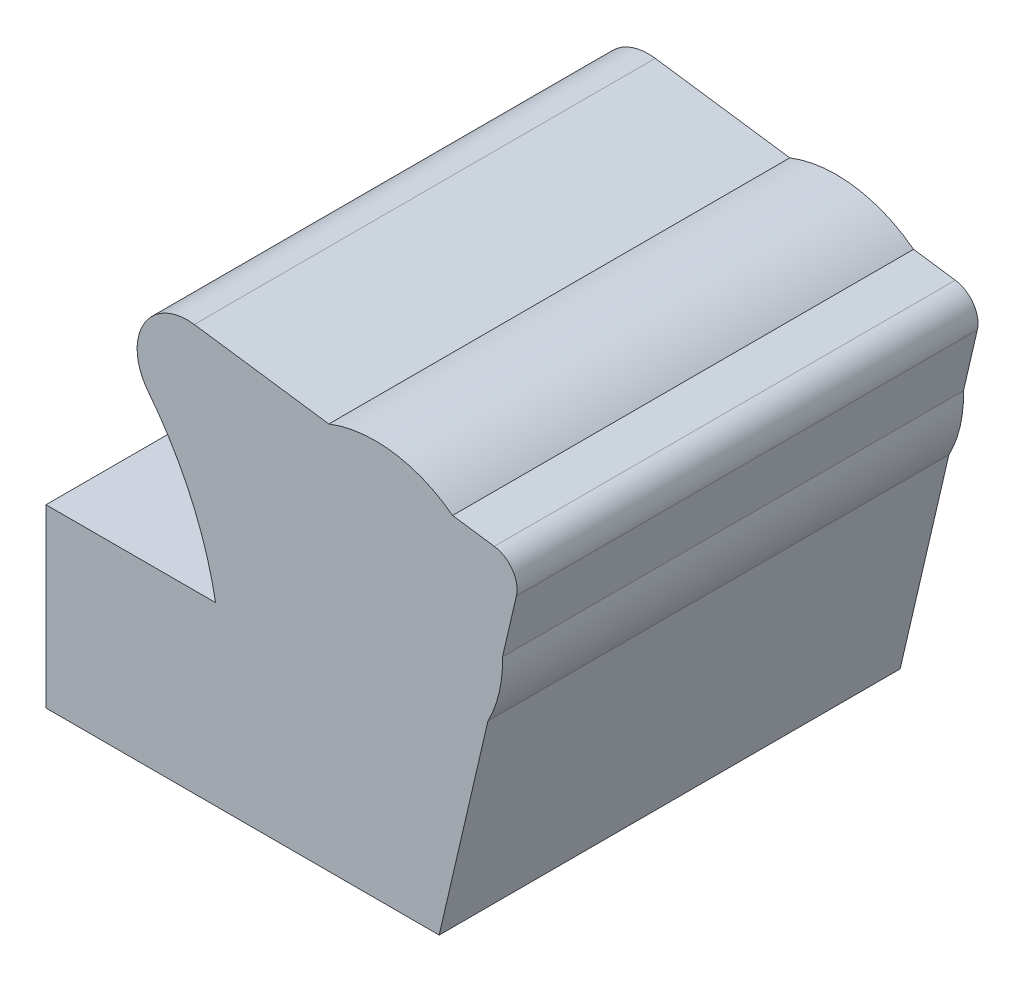
ISO-10303-21;
HEADER;
FILE_DESCRIPTION(('STEP AP214'),'2;1');
FILE_NAME('part.step','',(''),(''),'','','');
FILE_SCHEMA(('AUTOMOTIVE_DESIGN { 1 0 10303 214 1 1 1 1 }'));
ENDSEC;
DATA;
#1=APPLICATION_CONTEXT('core data for automotive mechanical design processes');
#2=APPLICATION_PROTOCOL_DEFINITION('international standard','automotive_design',2000,#1);
#3=PRODUCT_CONTEXT('',#1,'mechanical');
#4=PRODUCT('Part','Part','',(#3));
#5=PRODUCT_RELATED_PRODUCT_CATEGORY('part','',(#4));
#6=PRODUCT_DEFINITION_FORMATION('','',#4);
#7=PRODUCT_DEFINITION_CONTEXT('part definition',#1,'design');
#8=PRODUCT_DEFINITION('design','',#6,#7);
#9=PRODUCT_DEFINITION_SHAPE('','',#8);
#10=(LENGTH_UNIT() NAMED_UNIT(*) SI_UNIT(.MILLI.,.METRE.));
#11=(NAMED_UNIT(*) PLANE_ANGLE_UNIT() SI_UNIT($,.RADIAN.));
#12=(NAMED_UNIT(*) SI_UNIT($,.STERADIAN.) SOLID_ANGLE_UNIT());
#13=UNCERTAINTY_MEASURE_WITH_UNIT(LENGTH_MEASURE(1.E-05),#10,'distance_accuracy_value','');
#14=(GEOMETRIC_REPRESENTATION_CONTEXT(3) GLOBAL_UNCERTAINTY_ASSIGNED_CONTEXT((#13)) GLOBAL_UNIT_ASSIGNED_CONTEXT((#10,
#11,#12)) REPRESENTATION_CONTEXT('',''));
#15=CARTESIAN_POINT('',(0.,0.,0.));
#16=DIRECTION('',(0.,0.,1.));
#17=DIRECTION('',(1.,0.,0.));
#18=AXIS2_PLACEMENT_3D('',#15,#16,#17);
#19=CARTESIAN_POINT('',(19.0917847936775,72.5960375247347,50.));
#20=DIRECTION('',(0.,0.,-1.));
#21=DIRECTION('',(-1.,0.,0.));
#22=AXIS2_PLACEMENT_3D('',#19,#20,#21);
#23=CYLINDRICAL_SURFACE('',#22,74.3600000001127);
#24=CARTESIAN_POINT('',(19.0917847936775,72.5960375247347,-50.));
#25=DIRECTION('',(0.,0.,1.));
#26=DIRECTION('',(1.,0.,0.));
#27=AXIS2_PLACEMENT_3D('',#24,#25,#26);
#28=CIRCLE('',#27,74.3600000001127);
#29=CARTESIAN_POINT('',(77.5087076973694,118.605522617277,-50.));
#30=VERTEX_POINT('',#29);
#31=CARTESIAN_POINT('',(92.2028645129567,86.1673168416586,-50.));
#32=VERTEX_POINT('',#31);
#33=EDGE_CURVE('E238',#30,#32,#28,.F.);
#34=ORIENTED_EDGE('',*,*,#33,.T.);
#35=DIRECTION('',(0.,0.,-1.));
#36=VECTOR('',#35,1.);
#37=CARTESIAN_POINT('',(92.2028645129567,86.1673168416586,50.));
#38=LINE('',#37,#36);
#39=CARTESIAN_POINT('',(92.2028645129567,86.1673168416586,50.));
#40=VERTEX_POINT('',#39);
#41=EDGE_CURVE('E253',#40,#32,#38,.T.);
#42=ORIENTED_EDGE('',*,*,#41,.F.);
#43=CARTESIAN_POINT('',(19.0917847936775,72.5960375247347,50.));
#44=DIRECTION('',(0.,0.,1.));
#45=DIRECTION('',(1.,0.,0.));
#46=AXIS2_PLACEMENT_3D('',#43,#44,#45);
#47=CIRCLE('',#46,74.3600000001127);
#48=CARTESIAN_POINT('',(77.5087076973694,118.605522617277,50.));
#49=VERTEX_POINT('',#48);
#50=EDGE_CURVE('E283',#49,#40,#47,.F.);
#51=ORIENTED_EDGE('',*,*,#50,.F.);
#52=DIRECTION('',(0.,0.,-1.));
#53=VECTOR('',#52,1.);
#54=CARTESIAN_POINT('',(77.5087076973694,118.605522617277,50.));
#55=LINE('',#54,#53);
#56=EDGE_CURVE('E255',#49,#30,#55,.T.);
#57=ORIENTED_EDGE('',*,*,#56,.T.);
#58=EDGE_LOOP('',(#34,#42,#51,#57));
#59=FACE_BOUND('',#58,.T.);
#60=ADVANCED_FACE('F91',(#59),#23,.F.);
#61=CARTESIAN_POINT('',(86.0571495833471,125.338321778331,50.));
#62=DIRECTION('',(0.,0.,-1.));
#63=DIRECTION('',(-1.,0.,0.));
#64=AXIS2_PLACEMENT_3D('',#61,#62,#63);
#65=CYLINDRICAL_SURFACE('',#64,10.8814724748553);
#66=CARTESIAN_POINT('',(86.0571495833471,125.338321778331,-50.));
#67=DIRECTION('',(0.,0.,1.));
#68=DIRECTION('',(1.,0.,0.));
#69=AXIS2_PLACEMENT_3D('',#66,#67,#68);
#70=CIRCLE('',#69,10.8814724748553);
#71=CARTESIAN_POINT('',(87.5697361875638,136.114152372108,-50.));
#72=VERTEX_POINT('',#71);
#73=EDGE_CURVE('E236',#72,#30,#70,.T.);
#74=ORIENTED_EDGE('',*,*,#73,.T.);
#75=ORIENTED_EDGE('',*,*,#56,.F.);
#76=CARTESIAN_POINT('',(86.0571495833471,125.338321778331,50.));
#77=DIRECTION('',(0.,0.,1.));
#78=DIRECTION('',(1.,0.,0.));
#79=AXIS2_PLACEMENT_3D('',#76,#77,#78);
#80=CIRCLE('',#79,10.8814724748553);
#81=CARTESIAN_POINT('',(87.5697361875638,136.114152372108,50.));
#82=VERTEX_POINT('',#81);
#83=EDGE_CURVE('E281',#82,#49,#80,.T.);
#84=ORIENTED_EDGE('',*,*,#83,.F.);
#85=DIRECTION('',(0.,0.,-1.));
#86=VECTOR('',#85,1.);
#87=CARTESIAN_POINT('',(87.5697361875638,136.114152372108,50.));
#88=LINE('',#87,#86);
#89=EDGE_CURVE('E258',#82,#72,#88,.T.);
#90=ORIENTED_EDGE('',*,*,#89,.T.);
#91=EDGE_LOOP('',(#74,#75,#84,#90));
#92=FACE_BOUND('',#91,.T.);
#93=ADVANCED_FACE('F279',(#92),#65,.T.);
#94=CARTESIAN_POINT('',(20.4290257841441,145.538589613398,50.));
#95=DIRECTION('',(-0.139005691344815,-0.990291582198774,0.));
#96=DIRECTION('',(0.990291582198774,-0.139005691344815,0.));
#97=AXIS2_PLACEMENT_3D('',#94,#95,#96);
#98=PLANE('',#97);
#99=DIRECTION('',(-0.990291582198774,0.139005691344815,0.));
#100=VECTOR('',#99,1.);
#101=CARTESIAN_POINT('',(20.4290257841441,145.538589613398,-50.));
#102=LINE('',#101,#100);
#103=CARTESIAN_POINT('',(116.763782975271,132.016229366575,-50.));
#104=VERTEX_POINT('',#103);
#105=EDGE_CURVE('E234',#104,#72,#102,.T.);
#106=ORIENTED_EDGE('',*,*,#105,.T.);
#107=ORIENTED_EDGE('',*,*,#89,.F.);
#108=DIRECTION('',(-0.990291582198774,0.139005691344815,0.));
#109=VECTOR('',#108,1.);
#110=CARTESIAN_POINT('',(20.4290257841441,145.538589613398,50.));
#111=LINE('',#110,#109);
#112=CARTESIAN_POINT('',(116.763782975271,132.016229366575,50.));
#113=VERTEX_POINT('',#112);
#114=EDGE_CURVE('E284',#113,#82,#111,.T.);
#115=ORIENTED_EDGE('',*,*,#114,.F.);
#116=DIRECTION('',(0.,0.,-1.));
#117=VECTOR('',#116,1.);
#118=CARTESIAN_POINT('',(116.763782975271,132.016229366575,50.));
#119=LINE('',#118,#117);
#120=EDGE_CURVE('E261',#113,#104,#119,.T.);
#121=ORIENTED_EDGE('',*,*,#120,.T.);
#122=EDGE_LOOP('',(#106,#107,#115,#121));
#123=FACE_BOUND('',#122,.T.);
#124=ADVANCED_FACE('F275',(#123),#98,.F.);
#125=CARTESIAN_POINT('',(126.840999999996,106.3205,50.));
#126=DIRECTION('',(0.,0.,-1.));
#127=DIRECTION('',(-1.,0.,0.));
#128=AXIS2_PLACEMENT_3D('',#125,#126,#127);
#129=CYLINDRICAL_SURFACE('',#128,27.6011016201112);
#130=CARTESIAN_POINT('',(126.840999999996,106.3205,-50.));
#131=DIRECTION('',(0.,0.,1.));
#132=DIRECTION('',(1.,0.,0.));
#133=AXIS2_PLACEMENT_3D('',#130,#131,#132);
#134=CIRCLE('',#133,27.6011016201112);
#135=CARTESIAN_POINT('',(143.603132490778,128.248831559997,-50.));
#136=VERTEX_POINT('',#135);
#137=EDGE_CURVE('E231',#136,#104,#134,.T.);
#138=ORIENTED_EDGE('',*,*,#137,.T.);
#139=ORIENTED_EDGE('',*,*,#120,.F.);
#140=CARTESIAN_POINT('',(126.840999999996,106.3205,50.));
#141=DIRECTION('',(0.,0.,1.));
#142=DIRECTION('',(1.,0.,0.));
#143=AXIS2_PLACEMENT_3D('',#140,#141,#142);
#144=CIRCLE('',#143,27.6011016201112);
#145=CARTESIAN_POINT('',(143.603132490778,128.248831559997,50.));
#146=VERTEX_POINT('',#145);
#147=EDGE_CURVE('E268',#146,#113,#144,.T.);
#148=ORIENTED_EDGE('',*,*,#147,.F.);
#149=DIRECTION('',(0.,0.,-1.));
#150=VECTOR('',#149,1.);
#151=CARTESIAN_POINT('',(143.603132490778,128.248831559997,50.));
#152=LINE('',#151,#150);
#153=EDGE_CURVE('E209',#146,#136,#152,.T.);
#154=ORIENTED_EDGE('',*,*,#153,.T.);
#155=EDGE_LOOP('',(#138,#139,#148,#154));
#156=FACE_BOUND('',#155,.T.);
#157=ADVANCED_FACE('F264',(#156),#129,.T.);
#158=CARTESIAN_POINT('',(20.4290257841441,145.538589613398,50.));
#159=DIRECTION('',(-0.139005691344815,-0.990291582198774,0.));
#160=DIRECTION('',(0.990291582198774,-0.139005691344815,0.));
#161=AXIS2_PLACEMENT_3D('',#158,#159,#160);
#162=PLANE('',#161);
#163=DIRECTION('',(-0.990291582198774,0.139005691344815,0.));
#164=VECTOR('',#163,1.);
#165=CARTESIAN_POINT('',(20.4290257841441,145.538589613398,-50.));
#166=LINE('',#165,#164);
#167=CARTESIAN_POINT('',(152.661112554492,126.977376966646,-50.));
#168=VERTEX_POINT('',#167);
#169=EDGE_CURVE('E228',#168,#136,#166,.T.);
#170=ORIENTED_EDGE('',*,*,#169,.T.);
#171=ORIENTED_EDGE('',*,*,#153,.F.);
#172=DIRECTION('',(-0.990291582198774,0.139005691344815,0.));
#173=VECTOR('',#172,1.);
#174=CARTESIAN_POINT('',(20.4290257841441,145.538589613398,50.));
#175=LINE('',#174,#173);
#176=CARTESIAN_POINT('',(152.661112554492,126.977376966646,50.));
#177=VERTEX_POINT('',#176);
#178=EDGE_CURVE('E200',#177,#146,#175,.T.);
#179=ORIENTED_EDGE('',*,*,#178,.F.);
#180=DIRECTION('',(0.,0.,-1.));
#181=VECTOR('',#180,1.);
#182=CARTESIAN_POINT('',(152.661112554492,126.977376966646,50.));
#183=LINE('',#182,#181);
#184=EDGE_CURVE('E198',#177,#168,#183,.T.);
#185=ORIENTED_EDGE('',*,*,#184,.T.);
#186=EDGE_LOOP('',(#170,#171,#179,#185));
#187=FACE_BOUND('',#186,.T.);
#188=ADVANCED_FACE('F270',(#187),#162,.F.);
#189=CARTESIAN_POINT('',(151.866,121.312909116469,50.));
#190=DIRECTION('',(0.,0.,-1.));
#191=DIRECTION('',(-1.,0.,0.));
#192=AXIS2_PLACEMENT_3D('',#189,#190,#191);
#193=CYLINDRICAL_SURFACE('',#192,5.71999999999969);
#194=CARTESIAN_POINT('',(151.866,121.312909116469,-50.));
#195=DIRECTION('',(0.,0.,1.));
#196=DIRECTION('',(1.,0.,0.));
#197=AXIS2_PLACEMENT_3D('',#194,#195,#196);
#198=CIRCLE('',#197,5.71999999999969);
#199=CARTESIAN_POINT('',(157.437634446656,120.018579331278,-50.));
#200=VERTEX_POINT('',#199);
#201=EDGE_CURVE('E221',#200,#168,#198,.T.);
#202=ORIENTED_EDGE('',*,*,#201,.T.);
#203=ORIENTED_EDGE('',*,*,#184,.F.);
#204=CARTESIAN_POINT('',(151.866,121.312909116469,50.));
#205=DIRECTION('',(0.,0.,1.));
#206=DIRECTION('',(1.,0.,0.));
#207=AXIS2_PLACEMENT_3D('',#204,#205,#206);
#208=CIRCLE('',#207,5.71999999999969);
#209=CARTESIAN_POINT('',(157.437634446656,120.018579331278,50.));
#210=VERTEX_POINT('',#209);
#211=EDGE_CURVE('E184',#210,#177,#208,.T.);
#212=ORIENTED_EDGE('',*,*,#211,.F.);
#213=DIRECTION('',(0.,0.,-1.));
#214=VECTOR('',#213,1.);
#215=CARTESIAN_POINT('',(157.437634446656,120.018579331278,50.));
#216=LINE('',#215,#214);
#217=EDGE_CURVE('E196',#210,#200,#216,.T.);
#218=ORIENTED_EDGE('',*,*,#217,.T.);
#219=EDGE_LOOP('',(#202,#203,#212,#218));
#220=FACE_BOUND('',#219,.T.);
#221=ADVANCED_FACE('F195',(#220),#193,.T.);
#222=CARTESIAN_POINT('',(122.922758843374,-28.5558195843687,50.));
#223=DIRECTION('',(-0.974061966198678,0.22628143097737,0.));
#224=DIRECTION('',(-0.22628143097737,-0.974061966198678,0.));
#225=AXIS2_PLACEMENT_3D('',#222,#223,#224);
#226=PLANE('',#225);
#227=DIRECTION('',(0.,0.,-1.));
#228=VECTOR('',#227,1.);
#229=CARTESIAN_POINT('',(154.431677752707,107.07899310465,50.));
#230=LINE('',#229,#228);
#231=CARTESIAN_POINT('',(154.431677752707,107.07899310465,-50.));
#232=VERTEX_POINT('',#231);
#233=CARTESIAN_POINT('',(154.431677752707,107.07899310465,50.));
#234=VERTEX_POINT('',#233);
#235=EDGE_CURVE('E99',#232,#234,#230,.F.);
#236=ORIENTED_EDGE('',*,*,#235,.F.);
#237=DIRECTION('',(0.22628143097737,0.974061966198678,0.));
#238=VECTOR('',#237,1.);
#239=CARTESIAN_POINT('',(122.922758843374,-28.5558195843687,-50.));
#240=LINE('',#239,#238);
#241=EDGE_CURVE('E204',#232,#200,#240,.T.);
#242=ORIENTED_EDGE('',*,*,#241,.T.);
#243=ORIENTED_EDGE('',*,*,#217,.F.);
#244=DIRECTION('',(0.22628143097737,0.974061966198678,0.));
#245=VECTOR('',#244,1.);
#246=CARTESIAN_POINT('',(122.922758843374,-28.5558195843687,50.));
#247=LINE('',#246,#245);
#248=EDGE_CURVE('E179',#234,#210,#247,.T.);
#249=ORIENTED_EDGE('',*,*,#248,.F.);
#250=EDGE_LOOP('',(#236,#242,#243,#249));
#251=FACE_BOUND('',#250,.T.);
#252=ADVANCED_FACE('F202',(#251),#226,.F.);
#253=CARTESIAN_POINT('',(126.840999999996,106.3205,50.));
#254=DIRECTION('',(0.,0.,-1.));
#255=DIRECTION('',(-1.,0.,0.));
#256=AXIS2_PLACEMENT_3D('',#253,#254,#255);
#257=CYLINDRICAL_SURFACE('',#256,27.6011016201112);
#258=CARTESIAN_POINT('',(126.840999999996,106.3205,-50.));
#259=DIRECTION('',(0.,0.,1.));
#260=DIRECTION('',(1.,0.,0.));
#261=AXIS2_PLACEMENT_3D('',#258,#259,#260);
#262=CIRCLE('',#261,27.6011016201112);
#263=CARTESIAN_POINT('',(151.271848854584,93.477041163379,-50.));
#264=VERTEX_POINT('',#263);
#265=EDGE_CURVE('E214',#264,#232,#262,.T.);
#266=ORIENTED_EDGE('',*,*,#265,.T.);
#267=ORIENTED_EDGE('',*,*,#235,.T.);
#268=CARTESIAN_POINT('',(126.840999999996,106.3205,50.));
#269=DIRECTION('',(0.,0.,1.));
#270=DIRECTION('',(1.,0.,0.));
#271=AXIS2_PLACEMENT_3D('',#268,#269,#270);
#272=CIRCLE('',#271,27.6011016201112);
#273=CARTESIAN_POINT('',(151.271848854584,93.477041163379,50.));
#274=VERTEX_POINT('',#273);
#275=EDGE_CURVE('E188',#274,#234,#272,.T.);
#276=ORIENTED_EDGE('',*,*,#275,.F.);
#277=DIRECTION('',(0.,0.,-1.));
#278=VECTOR('',#277,1.);
#279=CARTESIAN_POINT('',(151.271848854584,93.477041163379,50.));
#280=LINE('',#279,#278);
#281=EDGE_CURVE('E206',#274,#264,#280,.T.);
#282=ORIENTED_EDGE('',*,*,#281,.T.);
#283=EDGE_LOOP('',(#266,#267,#276,#282));
#284=FACE_BOUND('',#283,.T.);
#285=ADVANCED_FACE('F93',(#284),#257,.T.);
#286=CARTESIAN_POINT('',(0.,86.1673168416586,50.));
#287=DIRECTION('',(0.,1.,0.));
#288=DIRECTION('',(0.,0.,1.));
#289=AXIS2_PLACEMENT_3D('',#286,#287,#288);
#290=PLANE('',#289);
#291=DIRECTION('',(1.,0.,0.));
#292=VECTOR('',#291,1.);
#293=CARTESIAN_POINT('',(0.,86.1673168416586,-50.));
#294=LINE('',#293,#292);
#295=CARTESIAN_POINT('',(55.4044049790674,86.1673168416586,-50.));
#296=VERTEX_POINT('',#295);
#297=EDGE_CURVE('E241',#296,#32,#294,.T.);
#298=ORIENTED_EDGE('',*,*,#297,.F.);
#299=DIRECTION('',(0.,0.,-1.));
#300=VECTOR('',#299,1.);
#301=CARTESIAN_POINT('',(55.4044049790674,86.1673168416586,50.));
#302=LINE('',#301,#300);
#303=CARTESIAN_POINT('',(55.4044049790674,86.1673168416586,50.));
#304=VERTEX_POINT('',#303);
#305=EDGE_CURVE('E250',#304,#296,#302,.T.);
#306=ORIENTED_EDGE('',*,*,#305,.F.);
#307=DIRECTION('',(1.,0.,0.));
#308=VECTOR('',#307,1.);
#309=CARTESIAN_POINT('',(0.,86.1673168416586,50.));
#310=LINE('',#309,#308);
#311=EDGE_CURVE('E286',#304,#40,#310,.T.);
#312=ORIENTED_EDGE('',*,*,#311,.T.);
#313=ORIENTED_EDGE('',*,*,#41,.T.);
#314=EDGE_LOOP('',(#298,#306,#312,#313));
#315=FACE_BOUND('',#314,.T.);
#316=ADVANCED_FACE('F307',(#315),#290,.T.);
#317=CARTESIAN_POINT('',(0.,0.,50.));
#318=DIRECTION('',(0.,0.,1.));
#319=DIRECTION('',(1.,0.,0.));
#320=AXIS2_PLACEMENT_3D('',#317,#318,#319);
#321=PLANE('',#320);
#322=DIRECTION('',(0.,1.,0.));
#323=VECTOR('',#322,1.);
#324=CARTESIAN_POINT('',(55.4044049790674,0.,50.));
#325=LINE('',#324,#323);
#326=CARTESIAN_POINT('',(55.4044049790674,47.9623912919101,50.));
#327=VERTEX_POINT('',#326);
#328=EDGE_CURVE('E292',#327,#304,#325,.T.);
#329=ORIENTED_EDGE('',*,*,#328,.F.);
#330=DIRECTION('',(1.,0.,0.));
#331=VECTOR('',#330,1.);
#332=CARTESIAN_POINT('',(0.,47.9623912919101,50.));
#333=LINE('',#332,#331);
#334=CARTESIAN_POINT('',(140.698476255362,47.9623912919101,50.));
#335=VERTEX_POINT('',#334);
#336=EDGE_CURVE('E112',#327,#335,#333,.T.);
#337=ORIENTED_EDGE('',*,*,#336,.T.);
#338=EDGE_CURVE('E191',#335,#274,#247,.T.);
#339=ORIENTED_EDGE('',*,*,#338,.T.);
#340=ORIENTED_EDGE('',*,*,#275,.T.);
#341=ORIENTED_EDGE('',*,*,#248,.T.);
#342=ORIENTED_EDGE('',*,*,#211,.T.);
#343=ORIENTED_EDGE('',*,*,#178,.T.);
#344=ORIENTED_EDGE('',*,*,#147,.T.);
#345=ORIENTED_EDGE('',*,*,#114,.T.);
#346=ORIENTED_EDGE('',*,*,#83,.T.);
#347=ORIENTED_EDGE('',*,*,#50,.T.);
#348=ORIENTED_EDGE('',*,*,#311,.F.);
#349=EDGE_LOOP('',(#329,#337,#339,#340,#341,#342,#343,#344,#345,#346,#347,#348));
#350=FACE_BOUND('',#349,.T.);
#351=ADVANCED_FACE('F182',(#350),#321,.T.);
#352=ORIENTED_EDGE('',*,*,#281,.F.);
#353=ORIENTED_EDGE('',*,*,#338,.F.);
#354=DIRECTION('',(0.,0.,-1.));
#355=VECTOR('',#354,1.);
#356=CARTESIAN_POINT('',(140.698476255362,47.9623912919101,50.));
#357=LINE('',#356,#355);
#358=CARTESIAN_POINT('',(140.698476255362,47.9623912919101,-50.));
#359=VERTEX_POINT('',#358);
#360=EDGE_CURVE('E247',#335,#359,#357,.T.);
#361=ORIENTED_EDGE('',*,*,#360,.T.);
#362=EDGE_CURVE('E222',#359,#264,#240,.T.);
#363=ORIENTED_EDGE('',*,*,#362,.T.);
#364=EDGE_LOOP('',(#352,#353,#361,#363));
#365=FACE_BOUND('',#364,.T.);
#366=ADVANCED_FACE('F299',(#365),#226,.F.);
#367=CARTESIAN_POINT('',(0.,0.,-50.));
#368=DIRECTION('',(0.,0.,1.));
#369=DIRECTION('',(1.,0.,0.));
#370=AXIS2_PLACEMENT_3D('',#367,#368,#369);
#371=PLANE('',#370);
#372=DIRECTION('',(1.,0.,0.));
#373=VECTOR('',#372,1.);
#374=CARTESIAN_POINT('',(0.,47.9623912919101,-50.));
#375=LINE('',#374,#373);
#376=CARTESIAN_POINT('',(55.4044049790674,47.9623912919101,-50.));
#377=VERTEX_POINT('',#376);
#378=EDGE_CURVE('E106',#377,#359,#375,.T.);
#379=ORIENTED_EDGE('',*,*,#378,.F.);
#380=DIRECTION('',(0.,1.,0.));
#381=VECTOR('',#380,1.);
#382=CARTESIAN_POINT('',(55.4044049790674,0.,-50.));
#383=LINE('',#382,#381);
#384=EDGE_CURVE('E244',#377,#296,#383,.T.);
#385=ORIENTED_EDGE('',*,*,#384,.T.);
#386=ORIENTED_EDGE('',*,*,#297,.T.);
#387=ORIENTED_EDGE('',*,*,#33,.F.);
#388=ORIENTED_EDGE('',*,*,#73,.F.);
#389=ORIENTED_EDGE('',*,*,#105,.F.);
#390=ORIENTED_EDGE('',*,*,#137,.F.);
#391=ORIENTED_EDGE('',*,*,#169,.F.);
#392=ORIENTED_EDGE('',*,*,#201,.F.);
#393=ORIENTED_EDGE('',*,*,#241,.F.);
#394=ORIENTED_EDGE('',*,*,#265,.F.);
#395=ORIENTED_EDGE('',*,*,#362,.F.);
#396=EDGE_LOOP('',(#379,#385,#386,#387,#388,#389,#390,#391,#392,#393,#394,#395));
#397=FACE_BOUND('',#396,.T.);
#398=ADVANCED_FACE('F219',(#397),#371,.F.);
#399=CARTESIAN_POINT('',(0.,47.9623912919101,50.));
#400=DIRECTION('',(0.,1.,0.));
#401=DIRECTION('',(0.,0.,1.));
#402=AXIS2_PLACEMENT_3D('',#399,#400,#401);
#403=PLANE('',#402);
#404=ORIENTED_EDGE('',*,*,#378,.T.);
#405=ORIENTED_EDGE('',*,*,#360,.F.);
#406=ORIENTED_EDGE('',*,*,#336,.F.);
#407=DIRECTION('',(0.,0.,-1.));
#408=VECTOR('',#407,1.);
#409=CARTESIAN_POINT('',(55.4044049790674,47.9623912919101,50.));
#410=LINE('',#409,#408);
#411=EDGE_CURVE('E12',#327,#377,#410,.T.);
#412=ORIENTED_EDGE('',*,*,#411,.T.);
#413=EDGE_LOOP('',(#404,#405,#406,#412));
#414=FACE_BOUND('',#413,.T.);
#415=ADVANCED_FACE('F297',(#414),#403,.F.);
#416=CARTESIAN_POINT('',(55.4044049790674,0.,50.));
#417=DIRECTION('',(-1.,0.,0.));
#418=DIRECTION('',(0.,-1.,0.));
#419=AXIS2_PLACEMENT_3D('',#416,#417,#418);
#420=PLANE('',#419);
#421=ORIENTED_EDGE('',*,*,#411,.F.);
#422=ORIENTED_EDGE('',*,*,#328,.T.);
#423=ORIENTED_EDGE('',*,*,#305,.T.);
#424=ORIENTED_EDGE('',*,*,#384,.F.);
#425=EDGE_LOOP('',(#421,#422,#423,#424));
#426=FACE_BOUND('',#425,.T.);
#427=ADVANCED_FACE('F311',(#426),#420,.T.);
#428=CLOSED_SHELL('',(#60,#93,#124,#157,#188,#221,#252,#285,#316,#351,#366,#398,#415,#427));
#429=MANIFOLD_SOLID_BREP('B2',#428);
#430=ADVANCED_BREP_SHAPE_REPRESENTATION('',(#18,#429),#14);
#431=SHAPE_DEFINITION_REPRESENTATION(#9,#430);
ENDSEC;
END-ISO-10303-21;
